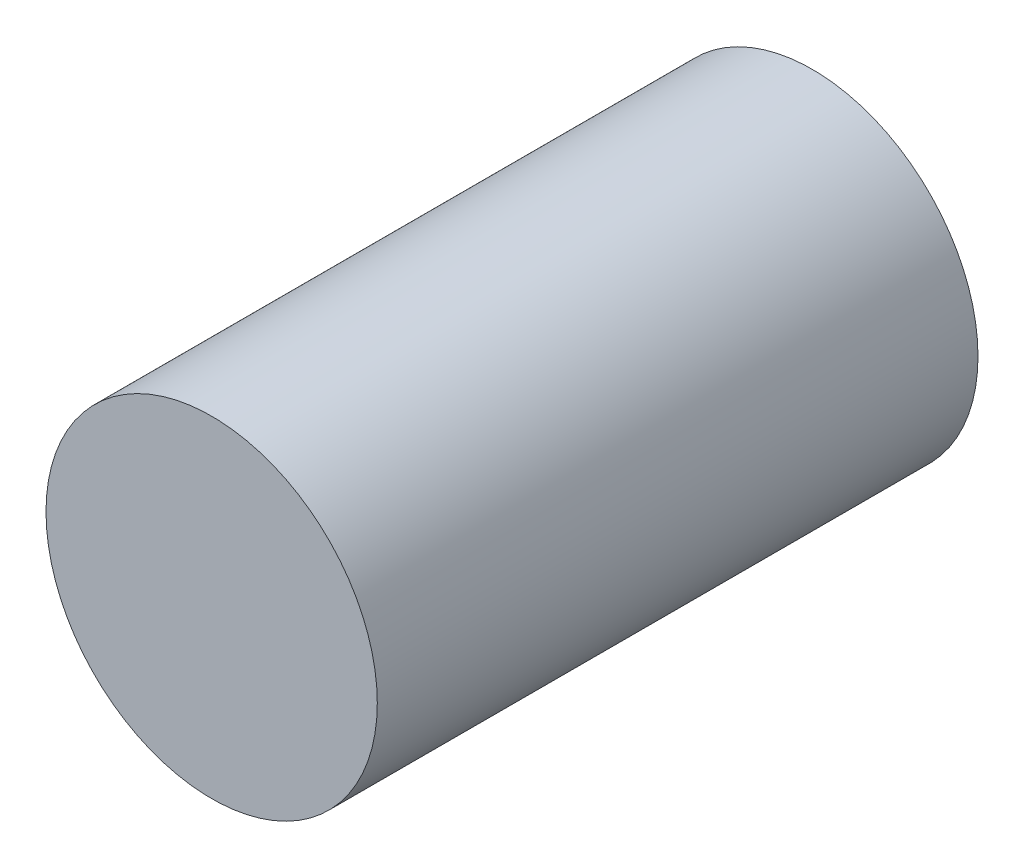
ISO-10303-21;
HEADER;
FILE_DESCRIPTION(('STEP AP214'),'2;1');
FILE_NAME('part.step','',(''),(''),'','','');
FILE_SCHEMA(('AUTOMOTIVE_DESIGN { 1 0 10303 214 1 1 1 1 }'));
ENDSEC;
DATA;
#1=APPLICATION_CONTEXT('core data for automotive mechanical design processes');
#2=APPLICATION_PROTOCOL_DEFINITION('international standard','automotive_design',2000,#1);
#3=PRODUCT_CONTEXT('',#1,'mechanical');
#4=PRODUCT('Part','Part','',(#3));
#5=PRODUCT_RELATED_PRODUCT_CATEGORY('part','',(#4));
#6=PRODUCT_DEFINITION_FORMATION('','',#4);
#7=PRODUCT_DEFINITION_CONTEXT('part definition',#1,'design');
#8=PRODUCT_DEFINITION('design','',#6,#7);
#9=PRODUCT_DEFINITION_SHAPE('','',#8);
#10=(LENGTH_UNIT() NAMED_UNIT(*) SI_UNIT(.MILLI.,.METRE.));
#11=(NAMED_UNIT(*) PLANE_ANGLE_UNIT() SI_UNIT($,.RADIAN.));
#12=(NAMED_UNIT(*) SI_UNIT($,.STERADIAN.) SOLID_ANGLE_UNIT());
#13=UNCERTAINTY_MEASURE_WITH_UNIT(LENGTH_MEASURE(1.E-05),#10,'distance_accuracy_value','');
#14=(GEOMETRIC_REPRESENTATION_CONTEXT(3) GLOBAL_UNCERTAINTY_ASSIGNED_CONTEXT((#13)) GLOBAL_UNIT_ASSIGNED_CONTEXT((#10,
#11,#12)) REPRESENTATION_CONTEXT('',''));
#15=CARTESIAN_POINT('',(0.,0.,0.));
#16=DIRECTION('',(0.,0.,1.));
#17=DIRECTION('',(1.,0.,0.));
#18=AXIS2_PLACEMENT_3D('',#15,#16,#17);
#19=CARTESIAN_POINT('',(-5.17048636981385,-0.728611750799996,17.95));
#20=DIRECTION('',(0.,0.,-1.));
#21=DIRECTION('',(-1.,0.,0.));
#22=AXIS2_PLACEMENT_3D('',#19,#20,#21);
#23=CYLINDRICAL_SURFACE('',#22,4.95);
#24=CARTESIAN_POINT('',(-5.17048636981385,-0.728611750799996,17.95));
#25=DIRECTION('',(0.,0.,1.));
#26=DIRECTION('',(1.,0.,0.));
#27=AXIS2_PLACEMENT_3D('',#24,#25,#26);
#28=CIRCLE('',#27,4.95);
#29=CARTESIAN_POINT('',(-0.220486369813848,-0.728611750799996,17.95));
#30=VERTEX_POINT('',#29);
#31=EDGE_CURVE('E10',#30,#30,#28,.T.);
#32=ORIENTED_EDGE('',*,*,#31,.F.);
#33=EDGE_LOOP('',(#32));
#34=FACE_BOUND('',#33,.T.);
#35=CARTESIAN_POINT('',(-5.17048636981385,-0.728611750799996,0.));
#36=DIRECTION('',(0.,0.,1.));
#37=DIRECTION('',(1.,0.,0.));
#38=AXIS2_PLACEMENT_3D('',#35,#36,#37);
#39=CIRCLE('',#38,4.95);
#40=CARTESIAN_POINT('',(-0.220486369813848,-0.728611750799996,0.));
#41=VERTEX_POINT('',#40);
#42=EDGE_CURVE('E44',#41,#41,#39,.T.);
#43=ORIENTED_EDGE('',*,*,#42,.T.);
#44=EDGE_LOOP('',(#43));
#45=FACE_BOUND('',#44,.T.);
#46=ADVANCED_FACE('F41',(#34,#45),#23,.T.);
#47=CARTESIAN_POINT('',(-5.17048636981385,-0.728611750799996,17.95));
#48=DIRECTION('',(0.,0.,1.));
#49=DIRECTION('',(1.,0.,0.));
#50=AXIS2_PLACEMENT_3D('',#47,#48,#49);
#51=PLANE('',#50);
#52=ORIENTED_EDGE('',*,*,#31,.T.);
#53=EDGE_LOOP('',(#52));
#54=FACE_BOUND('',#53,.T.);
#55=ADVANCED_FACE('F58',(#54),#51,.T.);
#56=CARTESIAN_POINT('',(-5.17048636981385,-0.728611750799996,0.));
#57=DIRECTION('',(0.,0.,1.));
#58=DIRECTION('',(1.,0.,0.));
#59=AXIS2_PLACEMENT_3D('',#56,#57,#58);
#60=PLANE('',#59);
#61=ORIENTED_EDGE('',*,*,#42,.F.);
#62=EDGE_LOOP('',(#61));
#63=FACE_BOUND('',#62,.T.);
#64=ADVANCED_FACE('F56',(#63),#60,.F.);
#65=CLOSED_SHELL('',(#46,#55,#64));
#66=MANIFOLD_SOLID_BREP('B2',#65);
#67=ADVANCED_BREP_SHAPE_REPRESENTATION('',(#18,#66),#14);
#68=SHAPE_DEFINITION_REPRESENTATION(#9,#67);
ENDSEC;
END-ISO-10303-21;
